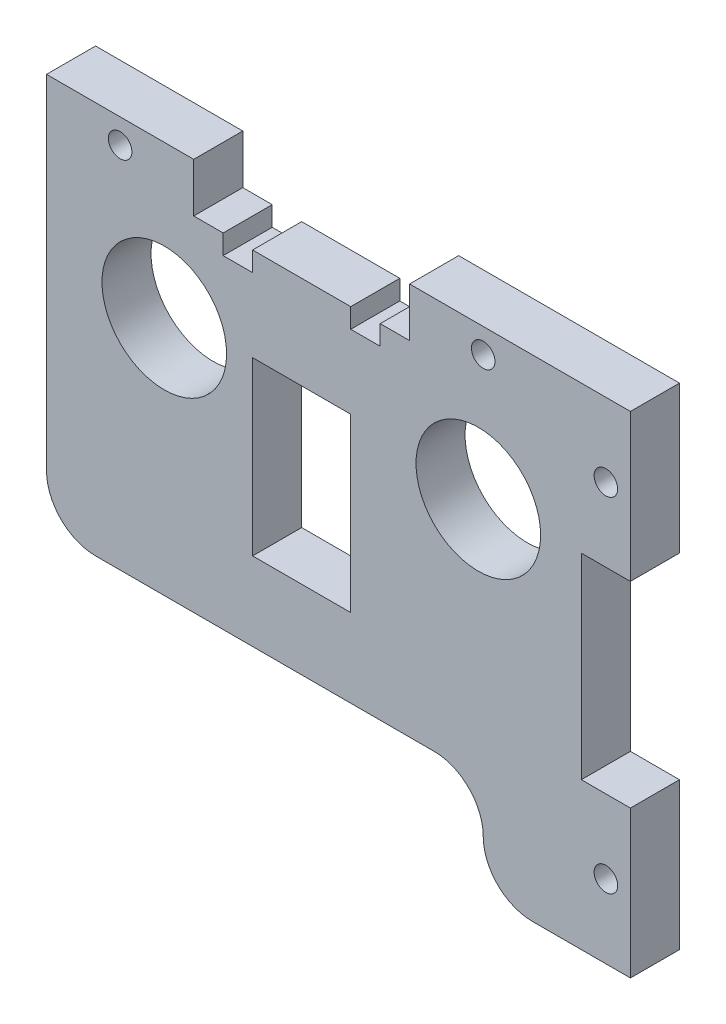
ISO-10303-21;
HEADER;
FILE_DESCRIPTION(('STEP AP214'),'2;1');
FILE_NAME('part.step','',(''),(''),'','','');
FILE_SCHEMA(('AUTOMOTIVE_DESIGN { 1 0 10303 214 1 1 1 1 }'));
ENDSEC;
DATA;
#1=APPLICATION_CONTEXT('core data for automotive mechanical design processes');
#2=APPLICATION_PROTOCOL_DEFINITION('international standard','automotive_design',2000,#1);
#3=PRODUCT_CONTEXT('',#1,'mechanical');
#4=PRODUCT('Part','Part','',(#3));
#5=PRODUCT_RELATED_PRODUCT_CATEGORY('part','',(#4));
#6=PRODUCT_DEFINITION_FORMATION('','',#4);
#7=PRODUCT_DEFINITION_CONTEXT('part definition',#1,'design');
#8=PRODUCT_DEFINITION('design','',#6,#7);
#9=PRODUCT_DEFINITION_SHAPE('','',#8);
#10=(LENGTH_UNIT() NAMED_UNIT(*) SI_UNIT(.MILLI.,.METRE.));
#11=(NAMED_UNIT(*) PLANE_ANGLE_UNIT() SI_UNIT($,.RADIAN.));
#12=(NAMED_UNIT(*) SI_UNIT($,.STERADIAN.) SOLID_ANGLE_UNIT());
#13=UNCERTAINTY_MEASURE_WITH_UNIT(LENGTH_MEASURE(1.E-05),#10,'distance_accuracy_value','');
#14=(GEOMETRIC_REPRESENTATION_CONTEXT(3) GLOBAL_UNCERTAINTY_ASSIGNED_CONTEXT((#13)) GLOBAL_UNIT_ASSIGNED_CONTEXT((#10,
#11,#12)) REPRESENTATION_CONTEXT('',''));
#15=CARTESIAN_POINT('',(0.,0.,0.));
#16=DIRECTION('',(0.,0.,1.));
#17=DIRECTION('',(1.,0.,0.));
#18=AXIS2_PLACEMENT_3D('',#15,#16,#17);
#19=CARTESIAN_POINT('',(15.,35.,5.));
#20=DIRECTION('',(0.,-1.,0.));
#21=DIRECTION('',(0.,0.,-1.));
#22=AXIS2_PLACEMENT_3D('',#19,#20,#21);
#23=PLANE('',#22);
#24=DIRECTION('',(-1.,0.,0.));
#25=VECTOR('',#24,1.);
#26=CARTESIAN_POINT('',(15.,35.,0.));
#27=LINE('',#26,#25);
#28=CARTESIAN_POINT('',(37.,35.,0.));
#29=VERTEX_POINT('',#28);
#30=CARTESIAN_POINT('',(34.,35.,0.));
#31=VERTEX_POINT('',#30);
#32=EDGE_CURVE('E235',#29,#31,#27,.T.);
#33=ORIENTED_EDGE('',*,*,#32,.T.);
#34=DIRECTION('',(0.,0.,1.));
#35=VECTOR('',#34,1.);
#36=CARTESIAN_POINT('',(34.,35.,0.));
#37=LINE('',#36,#35);
#38=CARTESIAN_POINT('',(34.,35.,5.));
#39=VERTEX_POINT('',#38);
#40=EDGE_CURVE('E216',#31,#39,#37,.T.);
#41=ORIENTED_EDGE('',*,*,#40,.T.);
#42=DIRECTION('',(-1.,0.,0.));
#43=VECTOR('',#42,1.);
#44=CARTESIAN_POINT('',(26.,35.,5.));
#45=LINE('',#44,#43);
#46=CARTESIAN_POINT('',(37.,35.,5.));
#47=VERTEX_POINT('',#46);
#48=EDGE_CURVE('E285',#47,#39,#45,.T.);
#49=ORIENTED_EDGE('',*,*,#48,.F.);
#50=DIRECTION('',(0.,0.,-1.));
#51=VECTOR('',#50,1.);
#52=CARTESIAN_POINT('',(37.,35.,5.));
#53=LINE('',#52,#51);
#54=EDGE_CURVE('E243',#47,#29,#53,.T.);
#55=ORIENTED_EDGE('',*,*,#54,.T.);
#56=EDGE_LOOP('',(#33,#41,#49,#55));
#57=FACE_BOUND('',#56,.T.);
#58=ADVANCED_FACE('F30',(#57),#23,.F.);
#59=CARTESIAN_POINT('',(31.,35.,5.));
#60=VERTEX_POINT('',#59);
#61=CARTESIAN_POINT('',(21.,35.,5.));
#62=VERTEX_POINT('',#61);
#63=EDGE_CURVE('E287',#60,#62,#45,.T.);
#64=ORIENTED_EDGE('',*,*,#63,.F.);
#65=DIRECTION('',(0.,0.,1.));
#66=VECTOR('',#65,1.);
#67=CARTESIAN_POINT('',(31.,35.,0.));
#68=LINE('',#67,#66);
#69=CARTESIAN_POINT('',(31.,35.,0.));
#70=VERTEX_POINT('',#69);
#71=EDGE_CURVE('E227',#70,#60,#68,.T.);
#72=ORIENTED_EDGE('',*,*,#71,.F.);
#73=CARTESIAN_POINT('',(21.,35.,0.));
#74=VERTEX_POINT('',#73);
#75=EDGE_CURVE('E245',#70,#74,#27,.T.);
#76=ORIENTED_EDGE('',*,*,#75,.T.);
#77=DIRECTION('',(0.,0.,1.));
#78=VECTOR('',#77,1.);
#79=CARTESIAN_POINT('',(21.,35.,0.));
#80=LINE('',#79,#78);
#81=EDGE_CURVE('E374',#74,#62,#80,.T.);
#82=ORIENTED_EDGE('',*,*,#81,.T.);
#83=EDGE_LOOP('',(#64,#72,#76,#82));
#84=FACE_BOUND('',#83,.T.);
#85=ADVANCED_FACE('F423',(#84),#23,.F.);
#86=CARTESIAN_POINT('',(0.,40.,5.));
#87=DIRECTION('',(0.,0.,-1.));
#88=DIRECTION('',(-1.,0.,0.));
#89=AXIS2_PLACEMENT_3D('',#86,#87,#88);
#90=PLANE('',#89);
#91=CARTESIAN_POINT('',(57.,32.5,5.));
#92=DIRECTION('',(0.,0.,1.));
#93=DIRECTION('',(1.,0.,0.));
#94=AXIS2_PLACEMENT_3D('',#91,#92,#93);
#95=CIRCLE('',#94,1.2);
#96=CARTESIAN_POINT('',(58.2,32.5,5.));
#97=VERTEX_POINT('',#96);
#98=EDGE_CURVE('E362',#97,#97,#95,.T.);
#99=ORIENTED_EDGE('',*,*,#98,.F.);
#100=EDGE_LOOP('',(#99));
#101=FACE_BOUND('',#100,.T.);
#102=CARTESIAN_POINT('',(7.5,37.5,5.));
#103=DIRECTION('',(0.,0.,1.));
#104=DIRECTION('',(1.,0.,0.));
#105=AXIS2_PLACEMENT_3D('',#102,#103,#104);
#106=CIRCLE('',#105,1.2);
#107=CARTESIAN_POINT('',(8.7,37.5,5.));
#108=VERTEX_POINT('',#107);
#109=EDGE_CURVE('E350',#108,#108,#106,.T.);
#110=ORIENTED_EDGE('',*,*,#109,.F.);
#111=EDGE_LOOP('',(#110));
#112=FACE_BOUND('',#111,.T.);
#113=CARTESIAN_POINT('',(12.,24.5,5.));
#114=DIRECTION('',(0.,0.,1.));
#115=DIRECTION('',(1.,0.,0.));
#116=AXIS2_PLACEMENT_3D('',#113,#114,#115);
#117=CIRCLE('',#116,6.35);
#118=CARTESIAN_POINT('',(18.35,24.5,5.));
#119=VERTEX_POINT('',#118);
#120=EDGE_CURVE('E333',#119,#119,#117,.T.);
#121=ORIENTED_EDGE('',*,*,#120,.F.);
#122=EDGE_LOOP('',(#121));
#123=FACE_BOUND('',#122,.T.);
#124=DIRECTION('',(1.,0.,0.));
#125=VECTOR('',#124,1.);
#126=CARTESIAN_POINT('',(44.5,0.,5.));
#127=LINE('',#126,#125);
#128=CARTESIAN_POINT('',(5.,0.,5.));
#129=VERTEX_POINT('',#128);
#130=CARTESIAN_POINT('',(39.5,0.,5.));
#131=VERTEX_POINT('',#130);
#132=EDGE_CURVE('E305',#129,#131,#127,.T.);
#133=ORIENTED_EDGE('',*,*,#132,.T.);
#134=CARTESIAN_POINT('',(39.5,-5.,5.));
#135=DIRECTION('',(0.,0.,-1.));
#136=DIRECTION('',(-1.,0.,0.));
#137=AXIS2_PLACEMENT_3D('',#134,#135,#136);
#138=CIRCLE('',#137,5.);
#139=CARTESIAN_POINT('',(44.5,-5.00000000000001,5.));
#140=VERTEX_POINT('',#139);
#141=EDGE_CURVE('E11',#131,#140,#138,.T.);
#142=ORIENTED_EDGE('',*,*,#141,.T.);
#143=CARTESIAN_POINT('',(49.5,-5.00000000000001,5.));
#144=DIRECTION('',(0.,0.,-1.));
#145=DIRECTION('',(-1.,0.,0.));
#146=AXIS2_PLACEMENT_3D('',#143,#144,#145);
#147=CIRCLE('',#146,5.);
#148=CARTESIAN_POINT('',(49.5,-10.,5.));
#149=VERTEX_POINT('',#148);
#150=EDGE_CURVE('E458',#140,#149,#147,.F.);
#151=ORIENTED_EDGE('',*,*,#150,.T.);
#152=DIRECTION('',(1.,0.,0.));
#153=VECTOR('',#152,1.);
#154=CARTESIAN_POINT('',(59.5,-10.,5.));
#155=LINE('',#154,#153);
#156=CARTESIAN_POINT('',(59.5,-10.,5.));
#157=VERTEX_POINT('',#156);
#158=EDGE_CURVE('E303',#149,#157,#155,.T.);
#159=ORIENTED_EDGE('',*,*,#158,.T.);
#160=DIRECTION('',(0.,1.,0.));
#161=VECTOR('',#160,1.);
#162=CARTESIAN_POINT('',(59.5,4.99999999999998,5.));
#163=LINE('',#162,#161);
#164=CARTESIAN_POINT('',(59.5,4.99999999999998,5.));
#165=VERTEX_POINT('',#164);
#166=EDGE_CURVE('E301',#157,#165,#163,.T.);
#167=ORIENTED_EDGE('',*,*,#166,.T.);
#168=DIRECTION('',(-1.,0.,0.));
#169=VECTOR('',#168,1.);
#170=CARTESIAN_POINT('',(54.5,4.99999999999998,5.));
#171=LINE('',#170,#169);
#172=CARTESIAN_POINT('',(54.5,4.99999999999998,5.));
#173=VERTEX_POINT('',#172);
#174=EDGE_CURVE('E299',#165,#173,#171,.T.);
#175=ORIENTED_EDGE('',*,*,#174,.T.);
#176=DIRECTION('',(0.,1.,0.));
#177=VECTOR('',#176,1.);
#178=CARTESIAN_POINT('',(54.5,25.,5.));
#179=LINE('',#178,#177);
#180=CARTESIAN_POINT('',(54.5,25.,5.));
#181=VERTEX_POINT('',#180);
#182=EDGE_CURVE('E297',#173,#181,#179,.T.);
#183=ORIENTED_EDGE('',*,*,#182,.T.);
#184=DIRECTION('',(1.,0.,0.));
#185=VECTOR('',#184,1.);
#186=CARTESIAN_POINT('',(59.5,25.,5.));
#187=LINE('',#186,#185);
#188=CARTESIAN_POINT('',(59.5,25.,5.));
#189=VERTEX_POINT('',#188);
#190=EDGE_CURVE('E295',#181,#189,#187,.T.);
#191=ORIENTED_EDGE('',*,*,#190,.T.);
#192=DIRECTION('',(0.,1.,0.));
#193=VECTOR('',#192,1.);
#194=CARTESIAN_POINT('',(59.5,40.,5.));
#195=LINE('',#194,#193);
#196=CARTESIAN_POINT('',(59.5,40.,5.));
#197=VERTEX_POINT('',#196);
#198=EDGE_CURVE('E293',#189,#197,#195,.T.);
#199=ORIENTED_EDGE('',*,*,#198,.T.);
#200=DIRECTION('',(-1.,0.,0.));
#201=VECTOR('',#200,1.);
#202=CARTESIAN_POINT('',(37.,40.,5.));
#203=LINE('',#202,#201);
#204=CARTESIAN_POINT('',(37.,40.,5.));
#205=VERTEX_POINT('',#204);
#206=EDGE_CURVE('E291',#197,#205,#203,.T.);
#207=ORIENTED_EDGE('',*,*,#206,.T.);
#208=DIRECTION('',(0.,-1.,0.));
#209=VECTOR('',#208,1.);
#210=CARTESIAN_POINT('',(37.,35.,5.));
#211=LINE('',#210,#209);
#212=EDGE_CURVE('E289',#205,#47,#211,.T.);
#213=ORIENTED_EDGE('',*,*,#212,.T.);
#214=ORIENTED_EDGE('',*,*,#48,.T.);
#215=DIRECTION('',(0.,1.,0.));
#216=VECTOR('',#215,1.);
#217=CARTESIAN_POINT('',(34.,35.,5.));
#218=LINE('',#217,#216);
#219=CARTESIAN_POINT('',(34.,33.,5.));
#220=VERTEX_POINT('',#219);
#221=EDGE_CURVE('E222',#220,#39,#218,.T.);
#222=ORIENTED_EDGE('',*,*,#221,.F.);
#223=DIRECTION('',(1.,0.,0.));
#224=VECTOR('',#223,1.);
#225=CARTESIAN_POINT('',(34.,33.,5.));
#226=LINE('',#225,#224);
#227=CARTESIAN_POINT('',(31.,33.,5.));
#228=VERTEX_POINT('',#227);
#229=EDGE_CURVE('E239',#228,#220,#226,.T.);
#230=ORIENTED_EDGE('',*,*,#229,.F.);
#231=DIRECTION('',(0.,-1.,0.));
#232=VECTOR('',#231,1.);
#233=CARTESIAN_POINT('',(31.,33.,5.));
#234=LINE('',#233,#232);
#235=EDGE_CURVE('E410',#60,#228,#234,.T.);
#236=ORIENTED_EDGE('',*,*,#235,.F.);
#237=ORIENTED_EDGE('',*,*,#63,.T.);
#238=DIRECTION('',(0.,1.,0.));
#239=VECTOR('',#238,1.);
#240=CARTESIAN_POINT('',(21.,33.,5.));
#241=LINE('',#240,#239);
#242=CARTESIAN_POINT('',(21.,33.,5.));
#243=VERTEX_POINT('',#242);
#244=EDGE_CURVE('E386',#243,#62,#241,.T.);
#245=ORIENTED_EDGE('',*,*,#244,.F.);
#246=DIRECTION('',(1.,0.,0.));
#247=VECTOR('',#246,1.);
#248=CARTESIAN_POINT('',(18.,33.,5.));
#249=LINE('',#248,#247);
#250=CARTESIAN_POINT('',(18.,33.,5.));
#251=VERTEX_POINT('',#250);
#252=EDGE_CURVE('E390',#251,#243,#249,.T.);
#253=ORIENTED_EDGE('',*,*,#252,.F.);
#254=DIRECTION('',(0.,-1.,0.));
#255=VECTOR('',#254,1.);
#256=CARTESIAN_POINT('',(18.,35.,5.));
#257=LINE('',#256,#255);
#258=CARTESIAN_POINT('',(18.,35.,5.));
#259=VERTEX_POINT('',#258);
#260=EDGE_CURVE('E393',#259,#251,#257,.T.);
#261=ORIENTED_EDGE('',*,*,#260,.F.);
#262=CARTESIAN_POINT('',(15.,35.,5.));
#263=VERTEX_POINT('',#262);
#264=EDGE_CURVE('E288',#259,#263,#45,.T.);
#265=ORIENTED_EDGE('',*,*,#264,.T.);
#266=DIRECTION('',(0.,1.,0.));
#267=VECTOR('',#266,1.);
#268=CARTESIAN_POINT('',(15.,40.,5.));
#269=LINE('',#268,#267);
#270=CARTESIAN_POINT('',(15.,40.,5.));
#271=VERTEX_POINT('',#270);
#272=EDGE_CURVE('E283',#263,#271,#269,.T.);
#273=ORIENTED_EDGE('',*,*,#272,.T.);
#274=DIRECTION('',(-1.,0.,0.));
#275=VECTOR('',#274,1.);
#276=CARTESIAN_POINT('',(0.,40.,5.));
#277=LINE('',#276,#275);
#278=CARTESIAN_POINT('',(0.,40.,5.));
#279=VERTEX_POINT('',#278);
#280=EDGE_CURVE('E280',#271,#279,#277,.T.);
#281=ORIENTED_EDGE('',*,*,#280,.T.);
#282=DIRECTION('',(0.,-1.,0.));
#283=VECTOR('',#282,1.);
#284=CARTESIAN_POINT('',(0.,0.,5.));
#285=LINE('',#284,#283);
#286=CARTESIAN_POINT('',(0.,5.,5.));
#287=VERTEX_POINT('',#286);
#288=EDGE_CURVE('E307',#279,#287,#285,.T.);
#289=ORIENTED_EDGE('',*,*,#288,.T.);
#290=CARTESIAN_POINT('',(5.,5.,5.));
#291=DIRECTION('',(0.,0.,-1.));
#292=DIRECTION('',(-1.,0.,0.));
#293=AXIS2_PLACEMENT_3D('',#290,#291,#292);
#294=CIRCLE('',#293,5.);
#295=EDGE_CURVE('E450',#287,#129,#294,.F.);
#296=ORIENTED_EDGE('',*,*,#295,.T.);
#297=EDGE_LOOP('',(#133,#142,#151,#159,#167,#175,#183,#191,#199,#207,#213,#214,#222,#230,#236,
#237,#245,#253,#261,#265,#273,#281,#289,#296));
#298=FACE_BOUND('',#297,.T.);
#299=DIRECTION('',(0.,-1.,0.));
#300=VECTOR('',#299,1.);
#301=CARTESIAN_POINT('',(21.,25.5,5.));
#302=LINE('',#301,#300);
#303=CARTESIAN_POINT('',(21.,25.5,5.));
#304=VERTEX_POINT('',#303);
#305=CARTESIAN_POINT('',(21.,8.,5.));
#306=VERTEX_POINT('',#305);
#307=EDGE_CURVE('E323',#304,#306,#302,.T.);
#308=ORIENTED_EDGE('',*,*,#307,.F.);
#309=DIRECTION('',(-1.,0.,0.));
#310=VECTOR('',#309,1.);
#311=CARTESIAN_POINT('',(21.,25.5,5.));
#312=LINE('',#311,#310);
#313=CARTESIAN_POINT('',(31.,25.5,5.));
#314=VERTEX_POINT('',#313);
#315=EDGE_CURVE('E319',#314,#304,#312,.T.);
#316=ORIENTED_EDGE('',*,*,#315,.F.);
#317=DIRECTION('',(0.,1.,0.));
#318=VECTOR('',#317,1.);
#319=CARTESIAN_POINT('',(31.,25.5,5.));
#320=LINE('',#319,#318);
#321=CARTESIAN_POINT('',(31.,8.,5.));
#322=VERTEX_POINT('',#321);
#323=EDGE_CURVE('E335',#322,#314,#320,.T.);
#324=ORIENTED_EDGE('',*,*,#323,.F.);
#325=DIRECTION('',(1.,0.,0.));
#326=VECTOR('',#325,1.);
#327=CARTESIAN_POINT('',(21.,8.,5.));
#328=LINE('',#327,#326);
#329=EDGE_CURVE('E338',#306,#322,#328,.T.);
#330=ORIENTED_EDGE('',*,*,#329,.F.);
#331=EDGE_LOOP('',(#308,#316,#324,#330));
#332=FACE_BOUND('',#331,.T.);
#333=CARTESIAN_POINT('',(44.,24.5,5.));
#334=DIRECTION('',(0.,0.,1.));
#335=DIRECTION('',(1.,0.,0.));
#336=AXIS2_PLACEMENT_3D('',#333,#334,#335);
#337=CIRCLE('',#336,6.35);
#338=CARTESIAN_POINT('',(50.35,24.5,5.));
#339=VERTEX_POINT('',#338);
#340=EDGE_CURVE('E344',#339,#339,#337,.T.);
#341=ORIENTED_EDGE('',*,*,#340,.F.);
#342=EDGE_LOOP('',(#341));
#343=FACE_BOUND('',#342,.T.);
#344=CARTESIAN_POINT('',(44.5,37.5,5.));
#345=DIRECTION('',(0.,0.,1.));
#346=DIRECTION('',(1.,0.,0.));
#347=AXIS2_PLACEMENT_3D('',#344,#345,#346);
#348=CIRCLE('',#347,1.2);
#349=CARTESIAN_POINT('',(45.7,37.5,5.));
#350=VERTEX_POINT('',#349);
#351=EDGE_CURVE('E356',#350,#350,#348,.T.);
#352=ORIENTED_EDGE('',*,*,#351,.F.);
#353=EDGE_LOOP('',(#352));
#354=FACE_BOUND('',#353,.T.);
#355=CARTESIAN_POINT('',(57.,-2.50000000000001,5.));
#356=DIRECTION('',(0.,0.,1.));
#357=DIRECTION('',(1.,0.,0.));
#358=AXIS2_PLACEMENT_3D('',#355,#356,#357);
#359=CIRCLE('',#358,1.2);
#360=CARTESIAN_POINT('',(58.2,-2.50000000000001,5.));
#361=VERTEX_POINT('',#360);
#362=EDGE_CURVE('E368',#361,#361,#359,.T.);
#363=ORIENTED_EDGE('',*,*,#362,.F.);
#364=EDGE_LOOP('',(#363));
#365=FACE_BOUND('',#364,.T.);
#366=ADVANCED_FACE('F428',(#101,#112,#123,#298,#332,#343,#354,#365),#90,.F.);
#367=CARTESIAN_POINT('',(0.,40.,0.));
#368=DIRECTION('',(0.,0.,-1.));
#369=DIRECTION('',(-1.,0.,0.));
#370=AXIS2_PLACEMENT_3D('',#367,#368,#369);
#371=PLANE('',#370);
#372=DIRECTION('',(1.,0.,0.));
#373=VECTOR('',#372,1.);
#374=CARTESIAN_POINT('',(59.5,-10.,0.));
#375=LINE('',#374,#373);
#376=CARTESIAN_POINT('',(49.5,-10.,0.));
#377=VERTEX_POINT('',#376);
#378=CARTESIAN_POINT('',(59.5,-10.,0.));
#379=VERTEX_POINT('',#378);
#380=EDGE_CURVE('E272',#377,#379,#375,.T.);
#381=ORIENTED_EDGE('',*,*,#380,.F.);
#382=CARTESIAN_POINT('',(49.5,-5.00000000000001,0.));
#383=DIRECTION('',(0.,0.,-1.));
#384=DIRECTION('',(-1.,0.,0.));
#385=AXIS2_PLACEMENT_3D('',#382,#383,#384);
#386=CIRCLE('',#385,5.);
#387=CARTESIAN_POINT('',(44.5,-5.00000000000001,0.));
#388=VERTEX_POINT('',#387);
#389=EDGE_CURVE('E459',#377,#388,#386,.T.);
#390=ORIENTED_EDGE('',*,*,#389,.T.);
#391=CARTESIAN_POINT('',(39.5,-5.,0.));
#392=DIRECTION('',(0.,0.,-1.));
#393=DIRECTION('',(-1.,0.,0.));
#394=AXIS2_PLACEMENT_3D('',#391,#392,#393);
#395=CIRCLE('',#394,5.);
#396=CARTESIAN_POINT('',(39.5,0.,0.));
#397=VERTEX_POINT('',#396);
#398=EDGE_CURVE('E39',#388,#397,#395,.F.);
#399=ORIENTED_EDGE('',*,*,#398,.T.);
#400=DIRECTION('',(1.,0.,0.));
#401=VECTOR('',#400,1.);
#402=CARTESIAN_POINT('',(44.5,0.,0.));
#403=LINE('',#402,#401);
#404=CARTESIAN_POINT('',(5.,0.,0.));
#405=VERTEX_POINT('',#404);
#406=EDGE_CURVE('E274',#405,#397,#403,.T.);
#407=ORIENTED_EDGE('',*,*,#406,.F.);
#408=CARTESIAN_POINT('',(5.,5.,0.));
#409=DIRECTION('',(0.,0.,-1.));
#410=DIRECTION('',(-1.,0.,0.));
#411=AXIS2_PLACEMENT_3D('',#408,#409,#410);
#412=CIRCLE('',#411,5.);
#413=CARTESIAN_POINT('',(0.,5.,0.));
#414=VERTEX_POINT('',#413);
#415=EDGE_CURVE('E462',#405,#414,#412,.T.);
#416=ORIENTED_EDGE('',*,*,#415,.T.);
#417=DIRECTION('',(0.,-1.,0.));
#418=VECTOR('',#417,1.);
#419=CARTESIAN_POINT('',(0.,0.,0.));
#420=LINE('',#419,#418);
#421=CARTESIAN_POINT('',(0.,40.,0.));
#422=VERTEX_POINT('',#421);
#423=EDGE_CURVE('E276',#422,#414,#420,.T.);
#424=ORIENTED_EDGE('',*,*,#423,.F.);
#425=DIRECTION('',(-1.,0.,0.));
#426=VECTOR('',#425,1.);
#427=CARTESIAN_POINT('',(0.,40.,0.));
#428=LINE('',#427,#426);
#429=CARTESIAN_POINT('',(15.,40.,0.));
#430=VERTEX_POINT('',#429);
#431=EDGE_CURVE('E248',#430,#422,#428,.T.);
#432=ORIENTED_EDGE('',*,*,#431,.F.);
#433=DIRECTION('',(0.,1.,0.));
#434=VECTOR('',#433,1.);
#435=CARTESIAN_POINT('',(15.,40.,0.));
#436=LINE('',#435,#434);
#437=CARTESIAN_POINT('',(15.,35.,0.));
#438=VERTEX_POINT('',#437);
#439=EDGE_CURVE('E244',#438,#430,#436,.T.);
#440=ORIENTED_EDGE('',*,*,#439,.F.);
#441=CARTESIAN_POINT('',(18.,35.,0.));
#442=VERTEX_POINT('',#441);
#443=EDGE_CURVE('E247',#442,#438,#27,.T.);
#444=ORIENTED_EDGE('',*,*,#443,.F.);
#445=DIRECTION('',(0.,-1.,0.));
#446=VECTOR('',#445,1.);
#447=CARTESIAN_POINT('',(18.,35.,0.));
#448=LINE('',#447,#446);
#449=CARTESIAN_POINT('',(18.,33.,0.));
#450=VERTEX_POINT('',#449);
#451=EDGE_CURVE('E389',#442,#450,#448,.T.);
#452=ORIENTED_EDGE('',*,*,#451,.T.);
#453=DIRECTION('',(1.,0.,0.));
#454=VECTOR('',#453,1.);
#455=CARTESIAN_POINT('',(18.,33.,0.));
#456=LINE('',#455,#454);
#457=CARTESIAN_POINT('',(21.,33.,0.));
#458=VERTEX_POINT('',#457);
#459=EDGE_CURVE('E399',#450,#458,#456,.T.);
#460=ORIENTED_EDGE('',*,*,#459,.T.);
#461=DIRECTION('',(0.,1.,0.));
#462=VECTOR('',#461,1.);
#463=CARTESIAN_POINT('',(21.,33.,0.));
#464=LINE('',#463,#462);
#465=EDGE_CURVE('E380',#458,#74,#464,.T.);
#466=ORIENTED_EDGE('',*,*,#465,.T.);
#467=ORIENTED_EDGE('',*,*,#75,.F.);
#468=DIRECTION('',(0.,-1.,0.));
#469=VECTOR('',#468,1.);
#470=CARTESIAN_POINT('',(31.,33.,0.));
#471=LINE('',#470,#469);
#472=CARTESIAN_POINT('',(31.,33.,0.));
#473=VERTEX_POINT('',#472);
#474=EDGE_CURVE('E238',#70,#473,#471,.T.);
#475=ORIENTED_EDGE('',*,*,#474,.T.);
#476=DIRECTION('',(1.,0.,0.));
#477=VECTOR('',#476,1.);
#478=CARTESIAN_POINT('',(34.,33.,0.));
#479=LINE('',#478,#477);
#480=CARTESIAN_POINT('',(34.,33.,0.));
#481=VERTEX_POINT('',#480);
#482=EDGE_CURVE('E228',#473,#481,#479,.T.);
#483=ORIENTED_EDGE('',*,*,#482,.T.);
#484=DIRECTION('',(0.,1.,0.));
#485=VECTOR('',#484,1.);
#486=CARTESIAN_POINT('',(34.,35.,0.));
#487=LINE('',#486,#485);
#488=EDGE_CURVE('E219',#481,#31,#487,.T.);
#489=ORIENTED_EDGE('',*,*,#488,.T.);
#490=ORIENTED_EDGE('',*,*,#32,.F.);
#491=DIRECTION('',(0.,-1.,0.));
#492=VECTOR('',#491,1.);
#493=CARTESIAN_POINT('',(37.,35.,0.));
#494=LINE('',#493,#492);
#495=CARTESIAN_POINT('',(37.,40.,0.));
#496=VERTEX_POINT('',#495);
#497=EDGE_CURVE('E251',#496,#29,#494,.T.);
#498=ORIENTED_EDGE('',*,*,#497,.F.);
#499=DIRECTION('',(-1.,0.,0.));
#500=VECTOR('',#499,1.);
#501=CARTESIAN_POINT('',(37.,40.,0.));
#502=LINE('',#501,#500);
#503=CARTESIAN_POINT('',(59.5,40.,0.));
#504=VERTEX_POINT('',#503);
#505=EDGE_CURVE('E257',#504,#496,#502,.T.);
#506=ORIENTED_EDGE('',*,*,#505,.F.);
#507=DIRECTION('',(0.,1.,0.));
#508=VECTOR('',#507,1.);
#509=CARTESIAN_POINT('',(59.5,40.,0.));
#510=LINE('',#509,#508);
#511=CARTESIAN_POINT('',(59.5,25.,0.));
#512=VERTEX_POINT('',#511);
#513=EDGE_CURVE('E260',#512,#504,#510,.T.);
#514=ORIENTED_EDGE('',*,*,#513,.F.);
#515=DIRECTION('',(1.,0.,0.));
#516=VECTOR('',#515,1.);
#517=CARTESIAN_POINT('',(59.5,25.,0.));
#518=LINE('',#517,#516);
#519=CARTESIAN_POINT('',(54.5,25.,0.));
#520=VERTEX_POINT('',#519);
#521=EDGE_CURVE('E264',#520,#512,#518,.T.);
#522=ORIENTED_EDGE('',*,*,#521,.F.);
#523=DIRECTION('',(0.,1.,0.));
#524=VECTOR('',#523,1.);
#525=CARTESIAN_POINT('',(54.5,25.,0.));
#526=LINE('',#525,#524);
#527=CARTESIAN_POINT('',(54.5,4.99999999999998,0.));
#528=VERTEX_POINT('',#527);
#529=EDGE_CURVE('E266',#528,#520,#526,.T.);
#530=ORIENTED_EDGE('',*,*,#529,.F.);
#531=DIRECTION('',(-1.,0.,0.));
#532=VECTOR('',#531,1.);
#533=CARTESIAN_POINT('',(54.5,4.99999999999998,0.));
#534=LINE('',#533,#532);
#535=CARTESIAN_POINT('',(59.5,4.99999999999998,0.));
#536=VERTEX_POINT('',#535);
#537=EDGE_CURVE('E268',#536,#528,#534,.T.);
#538=ORIENTED_EDGE('',*,*,#537,.F.);
#539=DIRECTION('',(0.,1.,0.));
#540=VECTOR('',#539,1.);
#541=CARTESIAN_POINT('',(59.5,4.99999999999998,0.));
#542=LINE('',#541,#540);
#543=EDGE_CURVE('E270',#379,#536,#542,.T.);
#544=ORIENTED_EDGE('',*,*,#543,.F.);
#545=EDGE_LOOP('',(#381,#390,#399,#407,#416,#424,#432,#440,#444,#452,#460,#466,#467,#475,#483,
#489,#490,#498,#506,#514,#522,#530,#538,#544));
#546=FACE_BOUND('',#545,.T.);
#547=CARTESIAN_POINT('',(57.,32.5,0.));
#548=DIRECTION('',(0.,0.,1.));
#549=DIRECTION('',(1.,0.,0.));
#550=AXIS2_PLACEMENT_3D('',#547,#548,#549);
#551=CIRCLE('',#550,1.2);
#552=CARTESIAN_POINT('',(58.2,32.5,0.));
#553=VERTEX_POINT('',#552);
#554=EDGE_CURVE('E365',#553,#553,#551,.T.);
#555=ORIENTED_EDGE('',*,*,#554,.T.);
#556=EDGE_LOOP('',(#555));
#557=FACE_BOUND('',#556,.T.);
#558=CARTESIAN_POINT('',(7.5,37.5,0.));
#559=DIRECTION('',(0.,0.,1.));
#560=DIRECTION('',(1.,0.,0.));
#561=AXIS2_PLACEMENT_3D('',#558,#559,#560);
#562=CIRCLE('',#561,1.2);
#563=CARTESIAN_POINT('',(8.7,37.5,0.));
#564=VERTEX_POINT('',#563);
#565=EDGE_CURVE('E353',#564,#564,#562,.T.);
#566=ORIENTED_EDGE('',*,*,#565,.T.);
#567=EDGE_LOOP('',(#566));
#568=FACE_BOUND('',#567,.T.);
#569=CARTESIAN_POINT('',(12.,24.5,0.));
#570=DIRECTION('',(0.,0.,1.));
#571=DIRECTION('',(1.,0.,0.));
#572=AXIS2_PLACEMENT_3D('',#569,#570,#571);
#573=CIRCLE('',#572,6.35);
#574=CARTESIAN_POINT('',(18.35,24.5,0.));
#575=VERTEX_POINT('',#574);
#576=EDGE_CURVE('E341',#575,#575,#573,.T.);
#577=ORIENTED_EDGE('',*,*,#576,.T.);
#578=EDGE_LOOP('',(#577));
#579=FACE_BOUND('',#578,.T.);
#580=DIRECTION('',(-1.,0.,0.));
#581=VECTOR('',#580,1.);
#582=CARTESIAN_POINT('',(21.,25.5,0.));
#583=LINE('',#582,#581);
#584=CARTESIAN_POINT('',(31.,25.5,0.));
#585=VERTEX_POINT('',#584);
#586=CARTESIAN_POINT('',(21.,25.5,0.));
#587=VERTEX_POINT('',#586);
#588=EDGE_CURVE('E320',#585,#587,#583,.T.);
#589=ORIENTED_EDGE('',*,*,#588,.T.);
#590=DIRECTION('',(0.,-1.,0.));
#591=VECTOR('',#590,1.);
#592=CARTESIAN_POINT('',(21.,25.5,0.));
#593=LINE('',#592,#591);
#594=CARTESIAN_POINT('',(21.,8.,0.));
#595=VERTEX_POINT('',#594);
#596=EDGE_CURVE('E330',#587,#595,#593,.T.);
#597=ORIENTED_EDGE('',*,*,#596,.T.);
#598=DIRECTION('',(1.,0.,0.));
#599=VECTOR('',#598,1.);
#600=CARTESIAN_POINT('',(21.,8.,0.));
#601=LINE('',#600,#599);
#602=CARTESIAN_POINT('',(31.,8.,0.));
#603=VERTEX_POINT('',#602);
#604=EDGE_CURVE('E327',#595,#603,#601,.T.);
#605=ORIENTED_EDGE('',*,*,#604,.T.);
#606=DIRECTION('',(0.,1.,0.));
#607=VECTOR('',#606,1.);
#608=CARTESIAN_POINT('',(31.,25.5,0.));
#609=LINE('',#608,#607);
#610=EDGE_CURVE('E324',#603,#585,#609,.T.);
#611=ORIENTED_EDGE('',*,*,#610,.T.);
#612=EDGE_LOOP('',(#589,#597,#605,#611));
#613=FACE_BOUND('',#612,.T.);
#614=CARTESIAN_POINT('',(44.,24.5,0.));
#615=DIRECTION('',(0.,0.,1.));
#616=DIRECTION('',(1.,0.,0.));
#617=AXIS2_PLACEMENT_3D('',#614,#615,#616);
#618=CIRCLE('',#617,6.35);
#619=CARTESIAN_POINT('',(50.35,24.5,0.));
#620=VERTEX_POINT('',#619);
#621=EDGE_CURVE('E347',#620,#620,#618,.T.);
#622=ORIENTED_EDGE('',*,*,#621,.T.);
#623=EDGE_LOOP('',(#622));
#624=FACE_BOUND('',#623,.T.);
#625=CARTESIAN_POINT('',(44.5,37.5,0.));
#626=DIRECTION('',(0.,0.,1.));
#627=DIRECTION('',(1.,0.,0.));
#628=AXIS2_PLACEMENT_3D('',#625,#626,#627);
#629=CIRCLE('',#628,1.2);
#630=CARTESIAN_POINT('',(45.7,37.5,0.));
#631=VERTEX_POINT('',#630);
#632=EDGE_CURVE('E359',#631,#631,#629,.T.);
#633=ORIENTED_EDGE('',*,*,#632,.T.);
#634=EDGE_LOOP('',(#633));
#635=FACE_BOUND('',#634,.T.);
#636=CARTESIAN_POINT('',(57.,-2.50000000000001,0.));
#637=DIRECTION('',(0.,0.,1.));
#638=DIRECTION('',(1.,0.,0.));
#639=AXIS2_PLACEMENT_3D('',#636,#637,#638);
#640=CIRCLE('',#639,1.2);
#641=CARTESIAN_POINT('',(58.2,-2.50000000000001,0.));
#642=VERTEX_POINT('',#641);
#643=EDGE_CURVE('E371',#642,#642,#640,.T.);
#644=ORIENTED_EDGE('',*,*,#643,.T.);
#645=EDGE_LOOP('',(#644));
#646=FACE_BOUND('',#645,.T.);
#647=ADVANCED_FACE('F232',(#546,#557,#568,#579,#613,#624,#635,#646),#371,.T.);
#648=CARTESIAN_POINT('',(0.,0.,5.));
#649=DIRECTION('',(1.,0.,0.));
#650=DIRECTION('',(0.,0.,-1.));
#651=AXIS2_PLACEMENT_3D('',#648,#649,#650);
#652=PLANE('',#651);
#653=ORIENTED_EDGE('',*,*,#423,.T.);
#654=DIRECTION('',(0.,0.,-1.));
#655=VECTOR('',#654,1.);
#656=CARTESIAN_POINT('',(0.,5.,5.));
#657=LINE('',#656,#655);
#658=EDGE_CURVE('E455',#414,#287,#657,.F.);
#659=ORIENTED_EDGE('',*,*,#658,.T.);
#660=ORIENTED_EDGE('',*,*,#288,.F.);
#661=DIRECTION('',(0.,0.,-1.));
#662=VECTOR('',#661,1.);
#663=CARTESIAN_POINT('',(0.,40.,5.));
#664=LINE('',#663,#662);
#665=EDGE_CURVE('E282',#279,#422,#664,.T.);
#666=ORIENTED_EDGE('',*,*,#665,.T.);
#667=EDGE_LOOP('',(#653,#659,#660,#666));
#668=FACE_BOUND('',#667,.T.);
#669=ADVANCED_FACE('F578',(#668),#652,.F.);
#670=CARTESIAN_POINT('',(44.5,0.,5.));
#671=DIRECTION('',(0.,1.,0.));
#672=DIRECTION('',(-1.,0.,0.));
#673=AXIS2_PLACEMENT_3D('',#670,#671,#672);
#674=PLANE('',#673);
#675=ORIENTED_EDGE('',*,*,#406,.T.);
#676=DIRECTION('',(0.,0.,-1.));
#677=VECTOR('',#676,1.);
#678=CARTESIAN_POINT('',(39.5,0.,5.));
#679=LINE('',#678,#677);
#680=EDGE_CURVE('E52',#397,#131,#679,.F.);
#681=ORIENTED_EDGE('',*,*,#680,.T.);
#682=ORIENTED_EDGE('',*,*,#132,.F.);
#683=DIRECTION('',(0.,0.,-1.));
#684=VECTOR('',#683,1.);
#685=CARTESIAN_POINT('',(5.,0.,5.));
#686=LINE('',#685,#684);
#687=EDGE_CURVE('E457',#129,#405,#686,.T.);
#688=ORIENTED_EDGE('',*,*,#687,.T.);
#689=EDGE_LOOP('',(#675,#681,#682,#688));
#690=FACE_BOUND('',#689,.T.);
#691=ADVANCED_FACE('F473',(#690),#674,.F.);
#692=CARTESIAN_POINT('',(59.5,-10.,5.));
#693=DIRECTION('',(0.,1.,0.));
#694=DIRECTION('',(-1.,0.,0.));
#695=AXIS2_PLACEMENT_3D('',#692,#693,#694);
#696=PLANE('',#695);
#697=ORIENTED_EDGE('',*,*,#158,.F.);
#698=DIRECTION('',(0.,0.,-1.));
#699=VECTOR('',#698,1.);
#700=CARTESIAN_POINT('',(49.5,-10.,5.));
#701=LINE('',#700,#699);
#702=EDGE_CURVE('E480',#149,#377,#701,.T.);
#703=ORIENTED_EDGE('',*,*,#702,.T.);
#704=ORIENTED_EDGE('',*,*,#380,.T.);
#705=DIRECTION('',(0.,0.,-1.));
#706=VECTOR('',#705,1.);
#707=CARTESIAN_POINT('',(59.5,-10.,5.));
#708=LINE('',#707,#706);
#709=EDGE_CURVE('E486',#157,#379,#708,.T.);
#710=ORIENTED_EDGE('',*,*,#709,.F.);
#711=EDGE_LOOP('',(#697,#703,#704,#710));
#712=FACE_BOUND('',#711,.T.);
#713=ADVANCED_FACE('F484',(#712),#696,.F.);
#714=CARTESIAN_POINT('',(59.5,4.99999999999998,5.));
#715=DIRECTION('',(-1.,0.,0.));
#716=DIRECTION('',(0.,0.,1.));
#717=AXIS2_PLACEMENT_3D('',#714,#715,#716);
#718=PLANE('',#717);
#719=ORIENTED_EDGE('',*,*,#543,.T.);
#720=DIRECTION('',(0.,0.,-1.));
#721=VECTOR('',#720,1.);
#722=CARTESIAN_POINT('',(59.5,4.99999999999998,5.));
#723=LINE('',#722,#721);
#724=EDGE_CURVE('E490',#165,#536,#723,.T.);
#725=ORIENTED_EDGE('',*,*,#724,.F.);
#726=ORIENTED_EDGE('',*,*,#166,.F.);
#727=ORIENTED_EDGE('',*,*,#709,.T.);
#728=EDGE_LOOP('',(#719,#725,#726,#727));
#729=FACE_BOUND('',#728,.T.);
#730=ADVANCED_FACE('F493',(#729),#718,.F.);
#731=CARTESIAN_POINT('',(54.5,4.99999999999998,5.));
#732=DIRECTION('',(0.,-1.,0.));
#733=DIRECTION('',(0.,0.,-1.));
#734=AXIS2_PLACEMENT_3D('',#731,#732,#733);
#735=PLANE('',#734);
#736=ORIENTED_EDGE('',*,*,#537,.T.);
#737=DIRECTION('',(0.,0.,-1.));
#738=VECTOR('',#737,1.);
#739=CARTESIAN_POINT('',(54.5,4.99999999999998,5.));
#740=LINE('',#739,#738);
#741=EDGE_CURVE('E501',#173,#528,#740,.T.);
#742=ORIENTED_EDGE('',*,*,#741,.F.);
#743=ORIENTED_EDGE('',*,*,#174,.F.);
#744=ORIENTED_EDGE('',*,*,#724,.T.);
#745=EDGE_LOOP('',(#736,#742,#743,#744));
#746=FACE_BOUND('',#745,.T.);
#747=ADVANCED_FACE('F502',(#746),#735,.F.);
#748=CARTESIAN_POINT('',(54.5,25.,5.));
#749=DIRECTION('',(-1.,0.,0.));
#750=DIRECTION('',(0.,-1.,0.));
#751=AXIS2_PLACEMENT_3D('',#748,#749,#750);
#752=PLANE('',#751);
#753=ORIENTED_EDGE('',*,*,#529,.T.);
#754=DIRECTION('',(0.,0.,-1.));
#755=VECTOR('',#754,1.);
#756=CARTESIAN_POINT('',(54.5,25.,5.));
#757=LINE('',#756,#755);
#758=EDGE_CURVE('E506',#181,#520,#757,.T.);
#759=ORIENTED_EDGE('',*,*,#758,.F.);
#760=ORIENTED_EDGE('',*,*,#182,.F.);
#761=ORIENTED_EDGE('',*,*,#741,.T.);
#762=EDGE_LOOP('',(#753,#759,#760,#761));
#763=FACE_BOUND('',#762,.T.);
#764=ADVANCED_FACE('F508',(#763),#752,.F.);
#765=CARTESIAN_POINT('',(59.5,25.,5.));
#766=DIRECTION('',(0.,1.,0.));
#767=DIRECTION('',(-1.,0.,0.));
#768=AXIS2_PLACEMENT_3D('',#765,#766,#767);
#769=PLANE('',#768);
#770=ORIENTED_EDGE('',*,*,#521,.T.);
#771=DIRECTION('',(0.,0.,-1.));
#772=VECTOR('',#771,1.);
#773=CARTESIAN_POINT('',(59.5,25.,5.));
#774=LINE('',#773,#772);
#775=EDGE_CURVE('E513',#189,#512,#774,.T.);
#776=ORIENTED_EDGE('',*,*,#775,.F.);
#777=ORIENTED_EDGE('',*,*,#190,.F.);
#778=ORIENTED_EDGE('',*,*,#758,.T.);
#779=EDGE_LOOP('',(#770,#776,#777,#778));
#780=FACE_BOUND('',#779,.T.);
#781=ADVANCED_FACE('F516',(#780),#769,.F.);
#782=CARTESIAN_POINT('',(59.5,40.,5.));
#783=DIRECTION('',(-1.,0.,0.));
#784=DIRECTION('',(0.,0.,1.));
#785=AXIS2_PLACEMENT_3D('',#782,#783,#784);
#786=PLANE('',#785);
#787=ORIENTED_EDGE('',*,*,#513,.T.);
#788=DIRECTION('',(0.,0.,-1.));
#789=VECTOR('',#788,1.);
#790=CARTESIAN_POINT('',(59.5,40.,5.));
#791=LINE('',#790,#789);
#792=EDGE_CURVE('E524',#197,#504,#791,.T.);
#793=ORIENTED_EDGE('',*,*,#792,.F.);
#794=ORIENTED_EDGE('',*,*,#198,.F.);
#795=ORIENTED_EDGE('',*,*,#775,.T.);
#796=EDGE_LOOP('',(#787,#793,#794,#795));
#797=FACE_BOUND('',#796,.T.);
#798=ADVANCED_FACE('F525',(#797),#786,.F.);
#799=CARTESIAN_POINT('',(37.,40.,5.));
#800=DIRECTION('',(0.,-1.,0.));
#801=DIRECTION('',(1.,0.,0.));
#802=AXIS2_PLACEMENT_3D('',#799,#800,#801);
#803=PLANE('',#802);
#804=ORIENTED_EDGE('',*,*,#505,.T.);
#805=DIRECTION('',(0.,0.,-1.));
#806=VECTOR('',#805,1.);
#807=CARTESIAN_POINT('',(37.,40.,5.));
#808=LINE('',#807,#806);
#809=EDGE_CURVE('E529',#205,#496,#808,.T.);
#810=ORIENTED_EDGE('',*,*,#809,.F.);
#811=ORIENTED_EDGE('',*,*,#206,.F.);
#812=ORIENTED_EDGE('',*,*,#792,.T.);
#813=EDGE_LOOP('',(#804,#810,#811,#812));
#814=FACE_BOUND('',#813,.T.);
#815=ADVANCED_FACE('F531',(#814),#803,.F.);
#816=CARTESIAN_POINT('',(37.,35.,5.));
#817=DIRECTION('',(1.,0.,0.));
#818=DIRECTION('',(0.,0.,-1.));
#819=AXIS2_PLACEMENT_3D('',#816,#817,#818);
#820=PLANE('',#819);
#821=ORIENTED_EDGE('',*,*,#497,.T.);
#822=ORIENTED_EDGE('',*,*,#54,.F.);
#823=ORIENTED_EDGE('',*,*,#212,.F.);
#824=ORIENTED_EDGE('',*,*,#809,.T.);
#825=EDGE_LOOP('',(#821,#822,#823,#824));
#826=FACE_BOUND('',#825,.T.);
#827=ADVANCED_FACE('F534',(#826),#820,.F.);
#828=ORIENTED_EDGE('',*,*,#264,.F.);
#829=DIRECTION('',(0.,0.,1.));
#830=VECTOR('',#829,1.);
#831=CARTESIAN_POINT('',(18.,35.,0.));
#832=LINE('',#831,#830);
#833=EDGE_CURVE('E377',#442,#259,#832,.T.);
#834=ORIENTED_EDGE('',*,*,#833,.F.);
#835=ORIENTED_EDGE('',*,*,#443,.T.);
#836=DIRECTION('',(0.,0.,-1.));
#837=VECTOR('',#836,1.);
#838=CARTESIAN_POINT('',(15.,35.,5.));
#839=LINE('',#838,#837);
#840=EDGE_CURVE('E433',#263,#438,#839,.T.);
#841=ORIENTED_EDGE('',*,*,#840,.F.);
#842=EDGE_LOOP('',(#828,#834,#835,#841));
#843=FACE_BOUND('',#842,.T.);
#844=ADVANCED_FACE('F434',(#843),#23,.F.);
#845=CARTESIAN_POINT('',(15.,40.,5.));
#846=DIRECTION('',(-1.,0.,0.));
#847=DIRECTION('',(0.,0.,1.));
#848=AXIS2_PLACEMENT_3D('',#845,#846,#847);
#849=PLANE('',#848);
#850=ORIENTED_EDGE('',*,*,#439,.T.);
#851=DIRECTION('',(0.,0.,-1.));
#852=VECTOR('',#851,1.);
#853=CARTESIAN_POINT('',(15.,40.,5.));
#854=LINE('',#853,#852);
#855=EDGE_CURVE('E437',#271,#430,#854,.T.);
#856=ORIENTED_EDGE('',*,*,#855,.F.);
#857=ORIENTED_EDGE('',*,*,#272,.F.);
#858=ORIENTED_EDGE('',*,*,#840,.T.);
#859=EDGE_LOOP('',(#850,#856,#857,#858));
#860=FACE_BOUND('',#859,.T.);
#861=ADVANCED_FACE('F439',(#860),#849,.F.);
#862=CARTESIAN_POINT('',(0.,40.,5.));
#863=DIRECTION('',(0.,-1.,0.));
#864=DIRECTION('',(0.,0.,-1.));
#865=AXIS2_PLACEMENT_3D('',#862,#863,#864);
#866=PLANE('',#865);
#867=ORIENTED_EDGE('',*,*,#431,.T.);
#868=ORIENTED_EDGE('',*,*,#665,.F.);
#869=ORIENTED_EDGE('',*,*,#280,.F.);
#870=ORIENTED_EDGE('',*,*,#855,.T.);
#871=EDGE_LOOP('',(#867,#868,#869,#870));
#872=FACE_BOUND('',#871,.T.);
#873=ADVANCED_FACE('F446',(#872),#866,.F.);
#874=CARTESIAN_POINT('',(21.,25.5,5.));
#875=DIRECTION('',(1.,0.,0.));
#876=DIRECTION('',(0.,1.,0.));
#877=AXIS2_PLACEMENT_3D('',#874,#875,#876);
#878=PLANE('',#877);
#879=ORIENTED_EDGE('',*,*,#596,.F.);
#880=DIRECTION('',(0.,0.,-1.));
#881=VECTOR('',#880,1.);
#882=CARTESIAN_POINT('',(21.,25.5,5.));
#883=LINE('',#882,#881);
#884=EDGE_CURVE('E316',#304,#587,#883,.T.);
#885=ORIENTED_EDGE('',*,*,#884,.F.);
#886=ORIENTED_EDGE('',*,*,#307,.T.);
#887=DIRECTION('',(0.,0.,-1.));
#888=VECTOR('',#887,1.);
#889=CARTESIAN_POINT('',(21.,8.,5.));
#890=LINE('',#889,#888);
#891=EDGE_CURVE('E279',#306,#595,#890,.T.);
#892=ORIENTED_EDGE('',*,*,#891,.T.);
#893=EDGE_LOOP('',(#879,#885,#886,#892));
#894=FACE_BOUND('',#893,.T.);
#895=ADVANCED_FACE('F685',(#894),#878,.T.);
#896=CARTESIAN_POINT('',(21.,8.,5.));
#897=DIRECTION('',(0.,1.,0.));
#898=DIRECTION('',(-1.,0.,0.));
#899=AXIS2_PLACEMENT_3D('',#896,#897,#898);
#900=PLANE('',#899);
#901=ORIENTED_EDGE('',*,*,#604,.F.);
#902=ORIENTED_EDGE('',*,*,#891,.F.);
#903=ORIENTED_EDGE('',*,*,#329,.T.);
#904=DIRECTION('',(0.,0.,-1.));
#905=VECTOR('',#904,1.);
#906=CARTESIAN_POINT('',(31.,8.,5.));
#907=LINE('',#906,#905);
#908=EDGE_CURVE('E312',#322,#603,#907,.T.);
#909=ORIENTED_EDGE('',*,*,#908,.T.);
#910=EDGE_LOOP('',(#901,#902,#903,#909));
#911=FACE_BOUND('',#910,.T.);
#912=ADVANCED_FACE('F693',(#911),#900,.T.);
#913=CARTESIAN_POINT('',(31.,25.5,5.));
#914=DIRECTION('',(-1.,0.,0.));
#915=DIRECTION('',(0.,0.,1.));
#916=AXIS2_PLACEMENT_3D('',#913,#914,#915);
#917=PLANE('',#916);
#918=ORIENTED_EDGE('',*,*,#610,.F.);
#919=ORIENTED_EDGE('',*,*,#908,.F.);
#920=ORIENTED_EDGE('',*,*,#323,.T.);
#921=DIRECTION('',(0.,0.,-1.));
#922=VECTOR('',#921,1.);
#923=CARTESIAN_POINT('',(31.,25.5,5.));
#924=LINE('',#923,#922);
#925=EDGE_CURVE('E314',#314,#585,#924,.T.);
#926=ORIENTED_EDGE('',*,*,#925,.T.);
#927=EDGE_LOOP('',(#918,#919,#920,#926));
#928=FACE_BOUND('',#927,.T.);
#929=ADVANCED_FACE('F702',(#928),#917,.T.);
#930=CARTESIAN_POINT('',(21.,25.5,5.));
#931=DIRECTION('',(0.,-1.,0.));
#932=DIRECTION('',(0.,0.,-1.));
#933=AXIS2_PLACEMENT_3D('',#930,#931,#932);
#934=PLANE('',#933);
#935=ORIENTED_EDGE('',*,*,#588,.F.);
#936=ORIENTED_EDGE('',*,*,#925,.F.);
#937=ORIENTED_EDGE('',*,*,#315,.T.);
#938=ORIENTED_EDGE('',*,*,#884,.T.);
#939=EDGE_LOOP('',(#935,#936,#937,#938));
#940=FACE_BOUND('',#939,.T.);
#941=ADVANCED_FACE('F711',(#940),#934,.T.);
#942=CARTESIAN_POINT('',(12.,24.5,5.));
#943=DIRECTION('',(0.,0.,-1.));
#944=DIRECTION('',(-1.,0.,0.));
#945=AXIS2_PLACEMENT_3D('',#942,#943,#944);
#946=CYLINDRICAL_SURFACE('',#945,6.35);
#947=ORIENTED_EDGE('',*,*,#120,.T.);
#948=EDGE_LOOP('',(#947));
#949=FACE_BOUND('',#948,.T.);
#950=ORIENTED_EDGE('',*,*,#576,.F.);
#951=EDGE_LOOP('',(#950));
#952=FACE_BOUND('',#951,.T.);
#953=ADVANCED_FACE('F720',(#949,#952),#946,.F.);
#954=CARTESIAN_POINT('',(44.,24.5,5.));
#955=DIRECTION('',(0.,0.,-1.));
#956=DIRECTION('',(-1.,0.,0.));
#957=AXIS2_PLACEMENT_3D('',#954,#955,#956);
#958=CYLINDRICAL_SURFACE('',#957,6.35);
#959=ORIENTED_EDGE('',*,*,#340,.T.);
#960=EDGE_LOOP('',(#959));
#961=FACE_BOUND('',#960,.T.);
#962=ORIENTED_EDGE('',*,*,#621,.F.);
#963=EDGE_LOOP('',(#962));
#964=FACE_BOUND('',#963,.T.);
#965=ADVANCED_FACE('F729',(#961,#964),#958,.F.);
#966=CARTESIAN_POINT('',(7.5,37.5,5.));
#967=DIRECTION('',(0.,0.,-1.));
#968=DIRECTION('',(-1.,0.,0.));
#969=AXIS2_PLACEMENT_3D('',#966,#967,#968);
#970=CYLINDRICAL_SURFACE('',#969,1.2);
#971=ORIENTED_EDGE('',*,*,#109,.T.);
#972=EDGE_LOOP('',(#971));
#973=FACE_BOUND('',#972,.T.);
#974=ORIENTED_EDGE('',*,*,#565,.F.);
#975=EDGE_LOOP('',(#974));
#976=FACE_BOUND('',#975,.T.);
#977=ADVANCED_FACE('F738',(#973,#976),#970,.F.);
#978=CARTESIAN_POINT('',(44.5,37.5,5.));
#979=DIRECTION('',(0.,0.,-1.));
#980=DIRECTION('',(-1.,0.,0.));
#981=AXIS2_PLACEMENT_3D('',#978,#979,#980);
#982=CYLINDRICAL_SURFACE('',#981,1.2);
#983=ORIENTED_EDGE('',*,*,#351,.T.);
#984=EDGE_LOOP('',(#983));
#985=FACE_BOUND('',#984,.T.);
#986=ORIENTED_EDGE('',*,*,#632,.F.);
#987=EDGE_LOOP('',(#986));
#988=FACE_BOUND('',#987,.T.);
#989=ADVANCED_FACE('F747',(#985,#988),#982,.F.);
#990=CARTESIAN_POINT('',(57.,32.5,5.));
#991=DIRECTION('',(0.,0.,-1.));
#992=DIRECTION('',(-1.,0.,0.));
#993=AXIS2_PLACEMENT_3D('',#990,#991,#992);
#994=CYLINDRICAL_SURFACE('',#993,1.2);
#995=ORIENTED_EDGE('',*,*,#98,.T.);
#996=EDGE_LOOP('',(#995));
#997=FACE_BOUND('',#996,.T.);
#998=ORIENTED_EDGE('',*,*,#554,.F.);
#999=EDGE_LOOP('',(#998));
#1000=FACE_BOUND('',#999,.T.);
#1001=ADVANCED_FACE('F756',(#997,#1000),#994,.F.);
#1002=CARTESIAN_POINT('',(57.,-2.50000000000001,5.));
#1003=DIRECTION('',(0.,0.,-1.));
#1004=DIRECTION('',(-1.,0.,0.));
#1005=AXIS2_PLACEMENT_3D('',#1002,#1003,#1004);
#1006=CYLINDRICAL_SURFACE('',#1005,1.2);
#1007=ORIENTED_EDGE('',*,*,#362,.T.);
#1008=EDGE_LOOP('',(#1007));
#1009=FACE_BOUND('',#1008,.T.);
#1010=ORIENTED_EDGE('',*,*,#643,.F.);
#1011=EDGE_LOOP('',(#1010));
#1012=FACE_BOUND('',#1011,.T.);
#1013=ADVANCED_FACE('F643',(#1009,#1012),#1006,.F.);
#1014=CARTESIAN_POINT('',(21.,33.,0.));
#1015=DIRECTION('',(1.,0.,0.));
#1016=DIRECTION('',(0.,0.,-1.));
#1017=AXIS2_PLACEMENT_3D('',#1014,#1015,#1016);
#1018=PLANE('',#1017);
#1019=ORIENTED_EDGE('',*,*,#244,.T.);
#1020=ORIENTED_EDGE('',*,*,#81,.F.);
#1021=ORIENTED_EDGE('',*,*,#465,.F.);
#1022=DIRECTION('',(0.,0.,1.));
#1023=VECTOR('',#1022,1.);
#1024=CARTESIAN_POINT('',(21.,33.,0.));
#1025=LINE('',#1024,#1023);
#1026=EDGE_CURVE('E382',#458,#243,#1025,.T.);
#1027=ORIENTED_EDGE('',*,*,#1026,.T.);
#1028=EDGE_LOOP('',(#1019,#1020,#1021,#1027));
#1029=FACE_BOUND('',#1028,.T.);
#1030=ADVANCED_FACE('F634',(#1029),#1018,.F.);
#1031=CARTESIAN_POINT('',(18.,33.,0.));
#1032=DIRECTION('',(0.,-1.,0.));
#1033=DIRECTION('',(0.,0.,-1.));
#1034=AXIS2_PLACEMENT_3D('',#1031,#1032,#1033);
#1035=PLANE('',#1034);
#1036=ORIENTED_EDGE('',*,*,#252,.T.);
#1037=ORIENTED_EDGE('',*,*,#1026,.F.);
#1038=ORIENTED_EDGE('',*,*,#459,.F.);
#1039=DIRECTION('',(0.,0.,1.));
#1040=VECTOR('',#1039,1.);
#1041=CARTESIAN_POINT('',(18.,33.,0.));
#1042=LINE('',#1041,#1040);
#1043=EDGE_CURVE('E379',#450,#251,#1042,.T.);
#1044=ORIENTED_EDGE('',*,*,#1043,.T.);
#1045=EDGE_LOOP('',(#1036,#1037,#1038,#1044));
#1046=FACE_BOUND('',#1045,.T.);
#1047=ADVANCED_FACE('F625',(#1046),#1035,.F.);
#1048=CARTESIAN_POINT('',(18.,35.,0.));
#1049=DIRECTION('',(-1.,0.,0.));
#1050=DIRECTION('',(0.,-1.,0.));
#1051=AXIS2_PLACEMENT_3D('',#1048,#1049,#1050);
#1052=PLANE('',#1051);
#1053=ORIENTED_EDGE('',*,*,#260,.T.);
#1054=ORIENTED_EDGE('',*,*,#1043,.F.);
#1055=ORIENTED_EDGE('',*,*,#451,.F.);
#1056=ORIENTED_EDGE('',*,*,#833,.T.);
#1057=EDGE_LOOP('',(#1053,#1054,#1055,#1056));
#1058=FACE_BOUND('',#1057,.T.);
#1059=ADVANCED_FACE('F545',(#1058),#1052,.F.);
#1060=CARTESIAN_POINT('',(34.,35.,0.));
#1061=DIRECTION('',(1.,0.,0.));
#1062=DIRECTION('',(0.,1.,0.));
#1063=AXIS2_PLACEMENT_3D('',#1060,#1061,#1062);
#1064=PLANE('',#1063);
#1065=ORIENTED_EDGE('',*,*,#221,.T.);
#1066=ORIENTED_EDGE('',*,*,#40,.F.);
#1067=ORIENTED_EDGE('',*,*,#488,.F.);
#1068=DIRECTION('',(0.,0.,1.));
#1069=VECTOR('',#1068,1.);
#1070=CARTESIAN_POINT('',(34.,33.,0.));
#1071=LINE('',#1070,#1069);
#1072=EDGE_CURVE('E396',#481,#220,#1071,.T.);
#1073=ORIENTED_EDGE('',*,*,#1072,.T.);
#1074=EDGE_LOOP('',(#1065,#1066,#1067,#1073));
#1075=FACE_BOUND('',#1074,.T.);
#1076=ADVANCED_FACE('F218',(#1075),#1064,.F.);
#1077=CARTESIAN_POINT('',(34.,33.,0.));
#1078=DIRECTION('',(0.,-1.,0.));
#1079=DIRECTION('',(1.,0.,0.));
#1080=AXIS2_PLACEMENT_3D('',#1077,#1078,#1079);
#1081=PLANE('',#1080);
#1082=ORIENTED_EDGE('',*,*,#229,.T.);
#1083=ORIENTED_EDGE('',*,*,#1072,.F.);
#1084=ORIENTED_EDGE('',*,*,#482,.F.);
#1085=DIRECTION('',(0.,0.,1.));
#1086=VECTOR('',#1085,1.);
#1087=CARTESIAN_POINT('',(31.,33.,0.));
#1088=LINE('',#1087,#1086);
#1089=EDGE_CURVE('E405',#473,#228,#1088,.T.);
#1090=ORIENTED_EDGE('',*,*,#1089,.T.);
#1091=EDGE_LOOP('',(#1082,#1083,#1084,#1090));
#1092=FACE_BOUND('',#1091,.T.);
#1093=ADVANCED_FACE('F537',(#1092),#1081,.F.);
#1094=CARTESIAN_POINT('',(31.,33.,0.));
#1095=DIRECTION('',(-1.,0.,0.));
#1096=DIRECTION('',(0.,-1.,0.));
#1097=AXIS2_PLACEMENT_3D('',#1094,#1095,#1096);
#1098=PLANE('',#1097);
#1099=ORIENTED_EDGE('',*,*,#235,.T.);
#1100=ORIENTED_EDGE('',*,*,#1089,.F.);
#1101=ORIENTED_EDGE('',*,*,#474,.F.);
#1102=ORIENTED_EDGE('',*,*,#71,.T.);
#1103=EDGE_LOOP('',(#1099,#1100,#1101,#1102));
#1104=FACE_BOUND('',#1103,.T.);
#1105=ADVANCED_FACE('F419',(#1104),#1098,.F.);
#1106=CARTESIAN_POINT('',(39.5,-5.,5.));
#1107=DIRECTION('',(0.,0.,1.));
#1108=DIRECTION('',(1.,0.,0.));
#1109=AXIS2_PLACEMENT_3D('',#1106,#1107,#1108);
#1110=CYLINDRICAL_SURFACE('',#1109,5.);
#1111=DIRECTION('',(0.,0.,-1.));
#1112=VECTOR('',#1111,1.);
#1113=CARTESIAN_POINT('',(44.5,-5.,0.));
#1114=LINE('',#1113,#1112);
#1115=EDGE_CURVE('E34',#140,#388,#1114,.T.);
#1116=ORIENTED_EDGE('',*,*,#1115,.F.);
#1117=ORIENTED_EDGE('',*,*,#141,.F.);
#1118=ORIENTED_EDGE('',*,*,#680,.F.);
#1119=ORIENTED_EDGE('',*,*,#398,.F.);
#1120=EDGE_LOOP('',(#1116,#1117,#1118,#1119));
#1121=FACE_BOUND('',#1120,.T.);
#1122=ADVANCED_FACE('F474',(#1121),#1110,.F.);
#1123=CARTESIAN_POINT('',(49.5,-5.00000000000001,5.));
#1124=DIRECTION('',(0.,0.,-1.));
#1125=DIRECTION('',(-1.,0.,0.));
#1126=AXIS2_PLACEMENT_3D('',#1123,#1124,#1125);
#1127=CYLINDRICAL_SURFACE('',#1126,5.);
#1128=ORIENTED_EDGE('',*,*,#150,.F.);
#1129=ORIENTED_EDGE('',*,*,#1115,.T.);
#1130=ORIENTED_EDGE('',*,*,#389,.F.);
#1131=ORIENTED_EDGE('',*,*,#702,.F.);
#1132=EDGE_LOOP('',(#1128,#1129,#1130,#1131));
#1133=FACE_BOUND('',#1132,.T.);
#1134=ADVANCED_FACE('F478',(#1133),#1127,.T.);
#1135=CARTESIAN_POINT('',(5.,5.,5.));
#1136=DIRECTION('',(0.,0.,-1.));
#1137=DIRECTION('',(-1.,0.,0.));
#1138=AXIS2_PLACEMENT_3D('',#1135,#1136,#1137);
#1139=CYLINDRICAL_SURFACE('',#1138,5.);
#1140=ORIENTED_EDGE('',*,*,#295,.F.);
#1141=ORIENTED_EDGE('',*,*,#658,.F.);
#1142=ORIENTED_EDGE('',*,*,#415,.F.);
#1143=ORIENTED_EDGE('',*,*,#687,.F.);
#1144=EDGE_LOOP('',(#1140,#1141,#1142,#1143));
#1145=FACE_BOUND('',#1144,.T.);
#1146=ADVANCED_FACE('F32',(#1145),#1139,.T.);
#1147=CLOSED_SHELL('',(#58,#85,#366,#647,#669,#691,#713,#730,#747,#764,#781,#798,#815,#827,#844,
#861,#873,#895,#912,#929,#941,#953,#965,#977,#989,#1001,#1013,#1030,#1047,#1059,#1076,#1093,
#1105,#1122,#1134,#1146));
#1148=MANIFOLD_SOLID_BREP('B2',#1147);
#1149=ADVANCED_BREP_SHAPE_REPRESENTATION('',(#18,#1148),#14);
#1150=SHAPE_DEFINITION_REPRESENTATION(#9,#1149);
ENDSEC;
END-ISO-10303-21;
